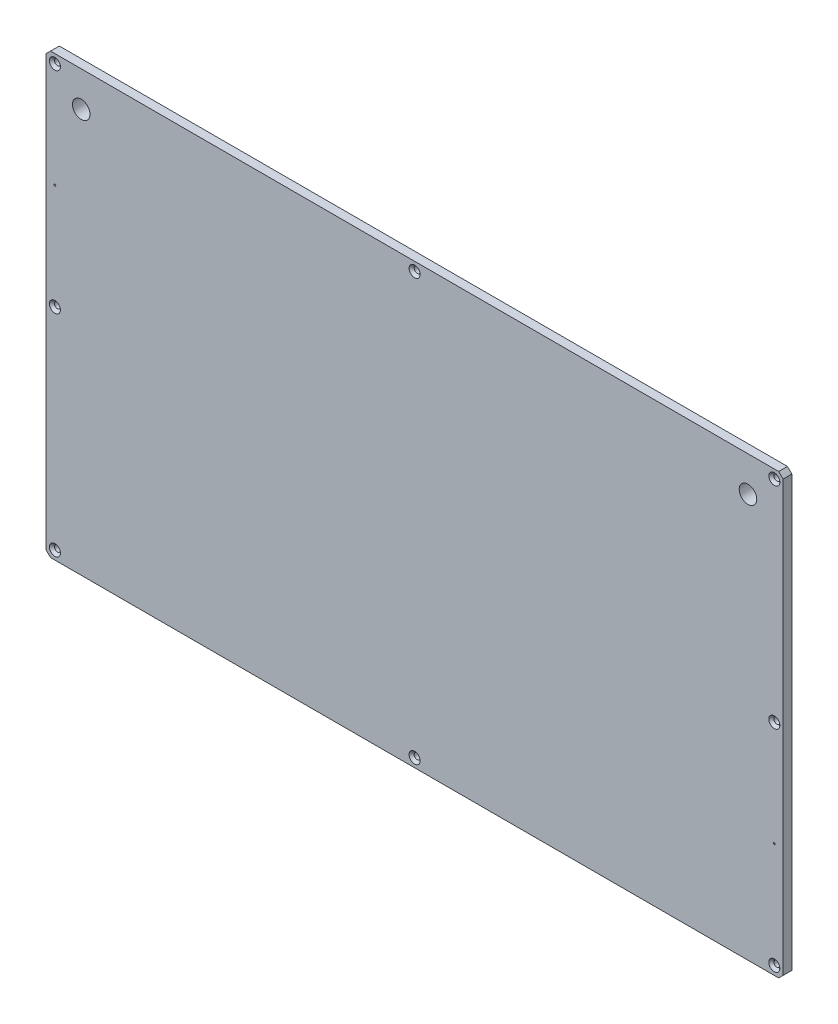
ISO-10303-21;
HEADER;
FILE_DESCRIPTION(('STEP AP214'),'2;1');
FILE_NAME('part.step','',(''),(''),'','','');
FILE_SCHEMA(('AUTOMOTIVE_DESIGN { 1 0 10303 214 1 1 1 1 }'));
ENDSEC;
DATA;
#1=APPLICATION_CONTEXT('core data for automotive mechanical design processes');
#2=APPLICATION_PROTOCOL_DEFINITION('international standard','automotive_design',2000,#1);
#3=PRODUCT_CONTEXT('',#1,'mechanical');
#4=PRODUCT('Part','Part','',(#3));
#5=PRODUCT_RELATED_PRODUCT_CATEGORY('part','',(#4));
#6=PRODUCT_DEFINITION_FORMATION('','',#4);
#7=PRODUCT_DEFINITION_CONTEXT('part definition',#1,'design');
#8=PRODUCT_DEFINITION('design','',#6,#7);
#9=PRODUCT_DEFINITION_SHAPE('','',#8);
#10=(LENGTH_UNIT() NAMED_UNIT(*) SI_UNIT(.MILLI.,.METRE.));
#11=(NAMED_UNIT(*) PLANE_ANGLE_UNIT() SI_UNIT($,.RADIAN.));
#12=(NAMED_UNIT(*) SI_UNIT($,.STERADIAN.) SOLID_ANGLE_UNIT());
#13=UNCERTAINTY_MEASURE_WITH_UNIT(LENGTH_MEASURE(1.E-05),#10,'distance_accuracy_value','');
#14=(GEOMETRIC_REPRESENTATION_CONTEXT(3) GLOBAL_UNCERTAINTY_ASSIGNED_CONTEXT((#13)) GLOBAL_UNIT_ASSIGNED_CONTEXT((#10,
#11,#12)) REPRESENTATION_CONTEXT('',''));
#15=CARTESIAN_POINT('',(0.,0.,0.));
#16=DIRECTION('',(0.,0.,1.));
#17=DIRECTION('',(1.,0.,0.));
#18=AXIS2_PLACEMENT_3D('',#15,#16,#17);
#19=CARTESIAN_POINT('',(-20.,-20.,-10.));
#20=DIRECTION('',(-1.,0.,0.));
#21=DIRECTION('',(0.,-1.,0.));
#22=AXIS2_PLACEMENT_3D('',#19,#20,#21);
#23=PLANE('',#22);
#24=DIRECTION('',(0.,0.,-1.));
#25=VECTOR('',#24,1.);
#26=CARTESIAN_POINT('',(-20.,227.5,-10.));
#27=LINE('',#26,#25);
#28=CARTESIAN_POINT('',(-20.,227.5,0.));
#29=VERTEX_POINT('',#28);
#30=CARTESIAN_POINT('',(-20.,227.5,-5.));
#31=VERTEX_POINT('',#30);
#32=EDGE_CURVE('E185',#29,#31,#27,.T.);
#33=ORIENTED_EDGE('',*,*,#32,.T.);
#34=DIRECTION('',(0.,-1.,0.));
#35=VECTOR('',#34,1.);
#36=CARTESIAN_POINT('',(-20.,-20.,-5.));
#37=LINE('',#36,#35);
#38=CARTESIAN_POINT('',(-20.,-17.5,-5.));
#39=VERTEX_POINT('',#38);
#40=EDGE_CURVE('E154',#31,#39,#37,.T.);
#41=ORIENTED_EDGE('',*,*,#40,.T.);
#42=DIRECTION('',(0.,0.,1.));
#43=VECTOR('',#42,1.);
#44=CARTESIAN_POINT('',(-20.,-17.5,-10.));
#45=LINE('',#44,#43);
#46=CARTESIAN_POINT('',(-20.,-17.5,0.));
#47=VERTEX_POINT('',#46);
#48=EDGE_CURVE('E187',#39,#47,#45,.T.);
#49=ORIENTED_EDGE('',*,*,#48,.T.);
#50=DIRECTION('',(0.,-1.,0.));
#51=VECTOR('',#50,1.);
#52=CARTESIAN_POINT('',(-20.,-20.,0.));
#53=LINE('',#52,#51);
#54=EDGE_CURVE('E354',#29,#47,#53,.T.);
#55=ORIENTED_EDGE('',*,*,#54,.F.);
#56=EDGE_LOOP('',(#33,#41,#49,#55));
#57=FACE_BOUND('',#56,.T.);
#58=ADVANCED_FACE('F34',(#57),#23,.T.);
#59=CARTESIAN_POINT('',(-20.,230.,-10.));
#60=DIRECTION('',(0.,1.,0.));
#61=DIRECTION('',(0.,0.,1.));
#62=AXIS2_PLACEMENT_3D('',#59,#60,#61);
#63=PLANE('',#62);
#64=DIRECTION('',(0.,0.,-1.));
#65=VECTOR('',#64,1.);
#66=CARTESIAN_POINT('',(397.5,230.,-10.));
#67=LINE('',#66,#65);
#68=CARTESIAN_POINT('',(397.5,230.,0.));
#69=VERTEX_POINT('',#68);
#70=CARTESIAN_POINT('',(397.5,230.,-5.));
#71=VERTEX_POINT('',#70);
#72=EDGE_CURVE('E168',#69,#71,#67,.T.);
#73=ORIENTED_EDGE('',*,*,#72,.T.);
#74=DIRECTION('',(-1.,0.,0.));
#75=VECTOR('',#74,1.);
#76=CARTESIAN_POINT('',(-20.,230.,-5.));
#77=LINE('',#76,#75);
#78=CARTESIAN_POINT('',(-17.5000000000001,230.,-5.));
#79=VERTEX_POINT('',#78);
#80=EDGE_CURVE('E151',#71,#79,#77,.T.);
#81=ORIENTED_EDGE('',*,*,#80,.T.);
#82=DIRECTION('',(0.,0.,1.));
#83=VECTOR('',#82,1.);
#84=CARTESIAN_POINT('',(-17.5000000000001,230.,-10.));
#85=LINE('',#84,#83);
#86=CARTESIAN_POINT('',(-17.5000000000001,230.,0.));
#87=VERTEX_POINT('',#86);
#88=EDGE_CURVE('E165',#79,#87,#85,.T.);
#89=ORIENTED_EDGE('',*,*,#88,.T.);
#90=DIRECTION('',(-1.,0.,0.));
#91=VECTOR('',#90,1.);
#92=CARTESIAN_POINT('',(-20.,230.,0.));
#93=LINE('',#92,#91);
#94=EDGE_CURVE('E363',#69,#87,#93,.T.);
#95=ORIENTED_EDGE('',*,*,#94,.F.);
#96=EDGE_LOOP('',(#73,#81,#89,#95));
#97=FACE_BOUND('',#96,.T.);
#98=ADVANCED_FACE('F163',(#97),#63,.T.);
#99=CARTESIAN_POINT('',(400.,-20.,-10.));
#100=DIRECTION('',(1.,0.,0.));
#101=DIRECTION('',(0.,0.,-1.));
#102=AXIS2_PLACEMENT_3D('',#99,#100,#101);
#103=PLANE('',#102);
#104=DIRECTION('',(0.,0.,-1.));
#105=VECTOR('',#104,1.);
#106=CARTESIAN_POINT('',(400.,-17.5,-10.));
#107=LINE('',#106,#105);
#108=CARTESIAN_POINT('',(400.,-17.5,0.));
#109=VERTEX_POINT('',#108);
#110=CARTESIAN_POINT('',(400.,-17.5,-5.));
#111=VERTEX_POINT('',#110);
#112=EDGE_CURVE('E365',#109,#111,#107,.T.);
#113=ORIENTED_EDGE('',*,*,#112,.T.);
#114=DIRECTION('',(0.,1.,0.));
#115=VECTOR('',#114,1.);
#116=CARTESIAN_POINT('',(400.,-20.,-5.));
#117=LINE('',#116,#115);
#118=CARTESIAN_POINT('',(400.,227.5,-5.));
#119=VERTEX_POINT('',#118);
#120=EDGE_CURVE('E300',#111,#119,#117,.T.);
#121=ORIENTED_EDGE('',*,*,#120,.T.);
#122=DIRECTION('',(0.,0.,1.));
#123=VECTOR('',#122,1.);
#124=CARTESIAN_POINT('',(400.,227.5,-10.));
#125=LINE('',#124,#123);
#126=CARTESIAN_POINT('',(400.,227.5,0.));
#127=VERTEX_POINT('',#126);
#128=EDGE_CURVE('E368',#119,#127,#125,.T.);
#129=ORIENTED_EDGE('',*,*,#128,.T.);
#130=DIRECTION('',(0.,1.,0.));
#131=VECTOR('',#130,1.);
#132=CARTESIAN_POINT('',(400.,-20.,0.));
#133=LINE('',#132,#131);
#134=EDGE_CURVE('E360',#109,#127,#133,.T.);
#135=ORIENTED_EDGE('',*,*,#134,.F.);
#136=EDGE_LOOP('',(#113,#121,#129,#135));
#137=FACE_BOUND('',#136,.T.);
#138=ADVANCED_FACE('F381',(#137),#103,.T.);
#139=CARTESIAN_POINT('',(-20.,-20.,-10.));
#140=DIRECTION('',(0.,-1.,0.));
#141=DIRECTION('',(1.,0.,0.));
#142=AXIS2_PLACEMENT_3D('',#139,#140,#141);
#143=PLANE('',#142);
#144=DIRECTION('',(0.,0.,-1.));
#145=VECTOR('',#144,1.);
#146=CARTESIAN_POINT('',(-17.4999999999999,-20.,-10.));
#147=LINE('',#146,#145);
#148=CARTESIAN_POINT('',(-17.4999999999999,-20.,0.));
#149=VERTEX_POINT('',#148);
#150=CARTESIAN_POINT('',(-17.4999999999999,-20.,-5.));
#151=VERTEX_POINT('',#150);
#152=EDGE_CURVE('E175',#149,#151,#147,.T.);
#153=ORIENTED_EDGE('',*,*,#152,.T.);
#154=DIRECTION('',(1.,0.,0.));
#155=VECTOR('',#154,1.);
#156=CARTESIAN_POINT('',(-20.,-20.,-5.));
#157=LINE('',#156,#155);
#158=CARTESIAN_POINT('',(397.5,-20.,-5.));
#159=VERTEX_POINT('',#158);
#160=EDGE_CURVE('E297',#151,#159,#157,.T.);
#161=ORIENTED_EDGE('',*,*,#160,.T.);
#162=DIRECTION('',(0.,0.,1.));
#163=VECTOR('',#162,1.);
#164=CARTESIAN_POINT('',(397.5,-20.,-10.));
#165=LINE('',#164,#163);
#166=CARTESIAN_POINT('',(397.5,-20.,0.));
#167=VERTEX_POINT('',#166);
#168=EDGE_CURVE('E183',#159,#167,#165,.T.);
#169=ORIENTED_EDGE('',*,*,#168,.T.);
#170=DIRECTION('',(1.,0.,0.));
#171=VECTOR('',#170,1.);
#172=CARTESIAN_POINT('',(-20.,-20.,0.));
#173=LINE('',#172,#171);
#174=EDGE_CURVE('E357',#149,#167,#173,.T.);
#175=ORIENTED_EDGE('',*,*,#174,.F.);
#176=EDGE_LOOP('',(#153,#161,#169,#175));
#177=FACE_BOUND('',#176,.T.);
#178=ADVANCED_FACE('F386',(#177),#143,.T.);
#179=CARTESIAN_POINT('',(400.,227.5,-10.));
#180=DIRECTION('',(-0.707106781186547,-0.707106781186547,0.));
#181=DIRECTION('',(0.,0.,1.));
#182=AXIS2_PLACEMENT_3D('',#179,#180,#181);
#183=PLANE('',#182);
#184=ORIENTED_EDGE('',*,*,#128,.F.);
#185=DIRECTION('',(0.707106781186548,-0.707106781186548,0.));
#186=VECTOR('',#185,1.);
#187=CARTESIAN_POINT('',(400.,227.5,-5.));
#188=LINE('',#187,#186);
#189=EDGE_CURVE('E295',#119,#71,#188,.F.);
#190=ORIENTED_EDGE('',*,*,#189,.T.);
#191=ORIENTED_EDGE('',*,*,#72,.F.);
#192=DIRECTION('',(0.707106781186548,-0.707106781186548,0.));
#193=VECTOR('',#192,1.);
#194=CARTESIAN_POINT('',(400.,227.5,0.));
#195=LINE('',#194,#193);
#196=EDGE_CURVE('E173',#127,#69,#195,.F.);
#197=ORIENTED_EDGE('',*,*,#196,.F.);
#198=EDGE_LOOP('',(#184,#190,#191,#197));
#199=FACE_BOUND('',#198,.T.);
#200=ADVANCED_FACE('F395',(#199),#183,.F.);
#201=CARTESIAN_POINT('',(397.5,-20.,-10.));
#202=DIRECTION('',(-0.707106781186547,0.707106781186547,0.));
#203=DIRECTION('',(0.,0.,1.));
#204=AXIS2_PLACEMENT_3D('',#201,#202,#203);
#205=PLANE('',#204);
#206=ORIENTED_EDGE('',*,*,#168,.F.);
#207=DIRECTION('',(-0.707106781186548,-0.707106781186548,0.));
#208=VECTOR('',#207,1.);
#209=CARTESIAN_POINT('',(397.5,-20.,-5.));
#210=LINE('',#209,#208);
#211=EDGE_CURVE('E303',#159,#111,#210,.F.);
#212=ORIENTED_EDGE('',*,*,#211,.T.);
#213=ORIENTED_EDGE('',*,*,#112,.F.);
#214=DIRECTION('',(-0.707106781186548,-0.707106781186548,0.));
#215=VECTOR('',#214,1.);
#216=CARTESIAN_POINT('',(397.5,-20.,0.));
#217=LINE('',#216,#215);
#218=EDGE_CURVE('E177',#167,#109,#217,.F.);
#219=ORIENTED_EDGE('',*,*,#218,.F.);
#220=EDGE_LOOP('',(#206,#212,#213,#219));
#221=FACE_BOUND('',#220,.T.);
#222=ADVANCED_FACE('F384',(#221),#205,.F.);
#223=CARTESIAN_POINT('',(-20.,-17.5,-10.));
#224=DIRECTION('',(0.70710678118654,0.707106781186555,0.));
#225=DIRECTION('',(0.,0.,1.));
#226=AXIS2_PLACEMENT_3D('',#223,#224,#225);
#227=PLANE('',#226);
#228=ORIENTED_EDGE('',*,*,#48,.F.);
#229=DIRECTION('',(-0.707106781186555,0.70710678118654,0.));
#230=VECTOR('',#229,1.);
#231=CARTESIAN_POINT('',(-20.,-17.5,-5.));
#232=LINE('',#231,#230);
#233=EDGE_CURVE('E292',#39,#151,#232,.F.);
#234=ORIENTED_EDGE('',*,*,#233,.T.);
#235=ORIENTED_EDGE('',*,*,#152,.F.);
#236=DIRECTION('',(-0.707106781186555,0.70710678118654,0.));
#237=VECTOR('',#236,1.);
#238=CARTESIAN_POINT('',(-20.,-17.5,0.));
#239=LINE('',#238,#237);
#240=EDGE_CURVE('E371',#47,#149,#239,.F.);
#241=ORIENTED_EDGE('',*,*,#240,.F.);
#242=EDGE_LOOP('',(#228,#234,#235,#241));
#243=FACE_BOUND('',#242,.T.);
#244=ADVANCED_FACE('F391',(#243),#227,.F.);
#245=CARTESIAN_POINT('',(-17.5000000000001,230.,-10.));
#246=DIRECTION('',(0.707106781186555,-0.70710678118654,0.));
#247=DIRECTION('',(0.,0.,1.));
#248=AXIS2_PLACEMENT_3D('',#245,#246,#247);
#249=PLANE('',#248);
#250=ORIENTED_EDGE('',*,*,#88,.F.);
#251=DIRECTION('',(0.70710678118654,0.707106781186555,0.));
#252=VECTOR('',#251,1.);
#253=CARTESIAN_POINT('',(-17.5000000000001,230.,-5.));
#254=LINE('',#253,#252);
#255=EDGE_CURVE('E148',#79,#31,#254,.F.);
#256=ORIENTED_EDGE('',*,*,#255,.T.);
#257=ORIENTED_EDGE('',*,*,#32,.F.);
#258=DIRECTION('',(0.70710678118654,0.707106781186555,0.));
#259=VECTOR('',#258,1.);
#260=CARTESIAN_POINT('',(-17.5000000000001,230.,0.));
#261=LINE('',#260,#259);
#262=EDGE_CURVE('E171',#87,#29,#261,.F.);
#263=ORIENTED_EDGE('',*,*,#262,.F.);
#264=EDGE_LOOP('',(#250,#256,#257,#263));
#265=FACE_BOUND('',#264,.T.);
#266=ADVANCED_FACE('F170',(#265),#249,.F.);
#267=CARTESIAN_POINT('',(395.,105.,0.));
#268=DIRECTION('',(0.,0.,1.));
#269=DIRECTION('',(1.,0.,0.));
#270=AXIS2_PLACEMENT_3D('',#267,#268,#269);
#271=CYLINDRICAL_SURFACE('',#270,1.69999999999998);
#272=CARTESIAN_POINT('',(395.,105.,-1.45000000000001));
#273=DIRECTION('',(0.,0.,1.));
#274=DIRECTION('',(1.,0.,0.));
#275=AXIS2_PLACEMENT_3D('',#272,#273,#274);
#276=CIRCLE('',#275,1.69999999999998);
#277=CARTESIAN_POINT('',(396.7,105.,-1.45000000000001));
#278=VERTEX_POINT('',#277);
#279=EDGE_CURVE('E351',#278,#278,#276,.T.);
#280=ORIENTED_EDGE('',*,*,#279,.T.);
#281=EDGE_LOOP('',(#280));
#282=FACE_BOUND('',#281,.T.);
#283=CARTESIAN_POINT('',(395.,105.,-5.));
#284=DIRECTION('',(0.,0.,-1.));
#285=DIRECTION('',(-1.,0.,0.));
#286=AXIS2_PLACEMENT_3D('',#283,#284,#285);
#287=CIRCLE('',#286,1.69999999999998);
#288=CARTESIAN_POINT('',(393.3,105.,-5.));
#289=VERTEX_POINT('',#288);
#290=EDGE_CURVE('E159',#289,#289,#287,.F.);
#291=ORIENTED_EDGE('',*,*,#290,.F.);
#292=EDGE_LOOP('',(#291));
#293=FACE_BOUND('',#292,.T.);
#294=ADVANCED_FACE('F424',(#282,#293),#271,.F.);
#295=CARTESIAN_POINT('',(-15.,105.,0.));
#296=DIRECTION('',(0.,0.,1.));
#297=DIRECTION('',(1.,0.,0.));
#298=AXIS2_PLACEMENT_3D('',#295,#296,#297);
#299=CYLINDRICAL_SURFACE('',#298,1.69999999999999);
#300=CARTESIAN_POINT('',(-15.,105.,-1.45000000000001));
#301=DIRECTION('',(0.,0.,1.));
#302=DIRECTION('',(1.,0.,0.));
#303=AXIS2_PLACEMENT_3D('',#300,#301,#302);
#304=CIRCLE('',#303,1.69999999999999);
#305=CARTESIAN_POINT('',(-13.3,105.,-1.45000000000001));
#306=VERTEX_POINT('',#305);
#307=EDGE_CURVE('E345',#306,#306,#304,.T.);
#308=ORIENTED_EDGE('',*,*,#307,.T.);
#309=EDGE_LOOP('',(#308));
#310=FACE_BOUND('',#309,.T.);
#311=CARTESIAN_POINT('',(-15.,105.,-5.));
#312=DIRECTION('',(0.,0.,-1.));
#313=DIRECTION('',(-1.,0.,0.));
#314=AXIS2_PLACEMENT_3D('',#311,#312,#313);
#315=CIRCLE('',#314,1.69999999999999);
#316=CARTESIAN_POINT('',(-16.7,105.,-5.));
#317=VERTEX_POINT('',#316);
#318=EDGE_CURVE('E286',#317,#317,#315,.F.);
#319=ORIENTED_EDGE('',*,*,#318,.F.);
#320=EDGE_LOOP('',(#319));
#321=FACE_BOUND('',#320,.T.);
#322=ADVANCED_FACE('F427',(#310,#321),#299,.F.);
#323=CARTESIAN_POINT('',(-15.,-15.,0.));
#324=DIRECTION('',(0.,0.,1.));
#325=DIRECTION('',(1.,0.,0.));
#326=AXIS2_PLACEMENT_3D('',#323,#324,#325);
#327=CYLINDRICAL_SURFACE('',#326,1.69999999999999);
#328=CARTESIAN_POINT('',(-15.,-15.,-1.45000000000001));
#329=DIRECTION('',(0.,0.,1.));
#330=DIRECTION('',(1.,0.,0.));
#331=AXIS2_PLACEMENT_3D('',#328,#329,#330);
#332=CIRCLE('',#331,1.69999999999999);
#333=CARTESIAN_POINT('',(-13.3,-15.,-1.45000000000001));
#334=VERTEX_POINT('',#333);
#335=EDGE_CURVE('E339',#334,#334,#332,.T.);
#336=ORIENTED_EDGE('',*,*,#335,.T.);
#337=EDGE_LOOP('',(#336));
#338=FACE_BOUND('',#337,.T.);
#339=CARTESIAN_POINT('',(-15.,-15.,-5.));
#340=DIRECTION('',(0.,0.,-1.));
#341=DIRECTION('',(-1.,0.,0.));
#342=AXIS2_PLACEMENT_3D('',#339,#340,#341);
#343=CIRCLE('',#342,1.69999999999999);
#344=CARTESIAN_POINT('',(-16.7,-15.,-5.));
#345=VERTEX_POINT('',#344);
#346=EDGE_CURVE('E283',#345,#345,#343,.F.);
#347=ORIENTED_EDGE('',*,*,#346,.F.);
#348=EDGE_LOOP('',(#347));
#349=FACE_BOUND('',#348,.T.);
#350=ADVANCED_FACE('F435',(#338,#349),#327,.F.);
#351=CARTESIAN_POINT('',(190.,-15.,0.));
#352=DIRECTION('',(0.,0.,1.));
#353=DIRECTION('',(1.,0.,0.));
#354=AXIS2_PLACEMENT_3D('',#351,#352,#353);
#355=CYLINDRICAL_SURFACE('',#354,1.69999999999998);
#356=CARTESIAN_POINT('',(190.,-15.,-1.45000000000001));
#357=DIRECTION('',(0.,0.,1.));
#358=DIRECTION('',(1.,0.,0.));
#359=AXIS2_PLACEMENT_3D('',#356,#357,#358);
#360=CIRCLE('',#359,1.69999999999998);
#361=CARTESIAN_POINT('',(191.7,-15.,-1.45000000000001));
#362=VERTEX_POINT('',#361);
#363=EDGE_CURVE('E333',#362,#362,#360,.T.);
#364=ORIENTED_EDGE('',*,*,#363,.T.);
#365=EDGE_LOOP('',(#364));
#366=FACE_BOUND('',#365,.T.);
#367=CARTESIAN_POINT('',(190.,-15.,-5.));
#368=DIRECTION('',(0.,0.,-1.));
#369=DIRECTION('',(-1.,0.,0.));
#370=AXIS2_PLACEMENT_3D('',#367,#368,#369);
#371=CIRCLE('',#370,1.69999999999998);
#372=CARTESIAN_POINT('',(188.3,-15.,-5.));
#373=VERTEX_POINT('',#372);
#374=EDGE_CURVE('E280',#373,#373,#371,.F.);
#375=ORIENTED_EDGE('',*,*,#374,.F.);
#376=EDGE_LOOP('',(#375));
#377=FACE_BOUND('',#376,.T.);
#378=ADVANCED_FACE('F443',(#366,#377),#355,.F.);
#379=CARTESIAN_POINT('',(395.,-15.,0.));
#380=DIRECTION('',(0.,0.,1.));
#381=DIRECTION('',(1.,0.,0.));
#382=AXIS2_PLACEMENT_3D('',#379,#380,#381);
#383=CYLINDRICAL_SURFACE('',#382,1.69999999999998);
#384=CARTESIAN_POINT('',(395.,-15.,-1.45000000000001));
#385=DIRECTION('',(0.,0.,1.));
#386=DIRECTION('',(1.,0.,0.));
#387=AXIS2_PLACEMENT_3D('',#384,#385,#386);
#388=CIRCLE('',#387,1.69999999999998);
#389=CARTESIAN_POINT('',(396.7,-15.,-1.45000000000001));
#390=VERTEX_POINT('',#389);
#391=EDGE_CURVE('E327',#390,#390,#388,.T.);
#392=ORIENTED_EDGE('',*,*,#391,.T.);
#393=EDGE_LOOP('',(#392));
#394=FACE_BOUND('',#393,.T.);
#395=CARTESIAN_POINT('',(395.,-15.,-5.));
#396=DIRECTION('',(0.,0.,-1.));
#397=DIRECTION('',(-1.,0.,0.));
#398=AXIS2_PLACEMENT_3D('',#395,#396,#397);
#399=CIRCLE('',#398,1.69999999999998);
#400=CARTESIAN_POINT('',(393.3,-15.,-5.));
#401=VERTEX_POINT('',#400);
#402=EDGE_CURVE('E277',#401,#401,#399,.F.);
#403=ORIENTED_EDGE('',*,*,#402,.F.);
#404=EDGE_LOOP('',(#403));
#405=FACE_BOUND('',#404,.T.);
#406=ADVANCED_FACE('F451',(#394,#405),#383,.F.);
#407=CARTESIAN_POINT('',(395.,225.,0.));
#408=DIRECTION('',(0.,0.,1.));
#409=DIRECTION('',(1.,0.,0.));
#410=AXIS2_PLACEMENT_3D('',#407,#408,#409);
#411=CYLINDRICAL_SURFACE('',#410,1.69999999999998);
#412=CARTESIAN_POINT('',(395.,225.,-1.45000000000001));
#413=DIRECTION('',(0.,0.,1.));
#414=DIRECTION('',(1.,0.,0.));
#415=AXIS2_PLACEMENT_3D('',#412,#413,#414);
#416=CIRCLE('',#415,1.69999999999998);
#417=CARTESIAN_POINT('',(396.7,225.,-1.45000000000001));
#418=VERTEX_POINT('',#417);
#419=EDGE_CURVE('E321',#418,#418,#416,.T.);
#420=ORIENTED_EDGE('',*,*,#419,.T.);
#421=EDGE_LOOP('',(#420));
#422=FACE_BOUND('',#421,.T.);
#423=CARTESIAN_POINT('',(395.,225.,-5.));
#424=DIRECTION('',(0.,0.,-1.));
#425=DIRECTION('',(-1.,0.,0.));
#426=AXIS2_PLACEMENT_3D('',#423,#424,#425);
#427=CIRCLE('',#426,1.69999999999998);
#428=CARTESIAN_POINT('',(393.3,225.,-5.));
#429=VERTEX_POINT('',#428);
#430=EDGE_CURVE('E274',#429,#429,#427,.F.);
#431=ORIENTED_EDGE('',*,*,#430,.F.);
#432=EDGE_LOOP('',(#431));
#433=FACE_BOUND('',#432,.T.);
#434=ADVANCED_FACE('F459',(#422,#433),#411,.F.);
#435=CARTESIAN_POINT('',(190.,225.,0.));
#436=DIRECTION('',(0.,0.,1.));
#437=DIRECTION('',(1.,0.,0.));
#438=AXIS2_PLACEMENT_3D('',#435,#436,#437);
#439=CYLINDRICAL_SURFACE('',#438,1.69999999999998);
#440=CARTESIAN_POINT('',(190.,225.,-1.45000000000001));
#441=DIRECTION('',(0.,0.,1.));
#442=DIRECTION('',(1.,0.,0.));
#443=AXIS2_PLACEMENT_3D('',#440,#441,#442);
#444=CIRCLE('',#443,1.69999999999998);
#445=CARTESIAN_POINT('',(191.7,225.,-1.45000000000001));
#446=VERTEX_POINT('',#445);
#447=EDGE_CURVE('E315',#446,#446,#444,.T.);
#448=ORIENTED_EDGE('',*,*,#447,.T.);
#449=EDGE_LOOP('',(#448));
#450=FACE_BOUND('',#449,.T.);
#451=CARTESIAN_POINT('',(190.,225.,-5.));
#452=DIRECTION('',(0.,0.,-1.));
#453=DIRECTION('',(-1.,0.,0.));
#454=AXIS2_PLACEMENT_3D('',#451,#452,#453);
#455=CIRCLE('',#454,1.69999999999998);
#456=CARTESIAN_POINT('',(188.3,225.,-5.));
#457=VERTEX_POINT('',#456);
#458=EDGE_CURVE('E193',#457,#457,#455,.F.);
#459=ORIENTED_EDGE('',*,*,#458,.F.);
#460=EDGE_LOOP('',(#459));
#461=FACE_BOUND('',#460,.T.);
#462=ADVANCED_FACE('F467',(#450,#461),#439,.F.);
#463=CARTESIAN_POINT('',(-15.,225.,0.));
#464=DIRECTION('',(0.,0.,1.));
#465=DIRECTION('',(1.,0.,0.));
#466=AXIS2_PLACEMENT_3D('',#463,#464,#465);
#467=CYLINDRICAL_SURFACE('',#466,1.69999999999999);
#468=CARTESIAN_POINT('',(-15.,225.,-1.45000000000001));
#469=DIRECTION('',(0.,0.,1.));
#470=DIRECTION('',(1.,0.,0.));
#471=AXIS2_PLACEMENT_3D('',#468,#469,#470);
#472=CIRCLE('',#471,1.69999999999999);
#473=CARTESIAN_POINT('',(-13.3,225.,-1.45000000000001));
#474=VERTEX_POINT('',#473);
#475=EDGE_CURVE('E309',#474,#474,#472,.T.);
#476=ORIENTED_EDGE('',*,*,#475,.T.);
#477=EDGE_LOOP('',(#476));
#478=FACE_BOUND('',#477,.T.);
#479=CARTESIAN_POINT('',(-15.,225.,-5.));
#480=DIRECTION('',(0.,0.,-1.));
#481=DIRECTION('',(-1.,0.,0.));
#482=AXIS2_PLACEMENT_3D('',#479,#480,#481);
#483=CIRCLE('',#482,1.69999999999999);
#484=CARTESIAN_POINT('',(-16.7,225.,-5.));
#485=VERTEX_POINT('',#484);
#486=EDGE_CURVE('E190',#485,#485,#483,.F.);
#487=ORIENTED_EDGE('',*,*,#486,.F.);
#488=EDGE_LOOP('',(#487));
#489=FACE_BOUND('',#488,.T.);
#490=ADVANCED_FACE('F416',(#478,#489),#467,.F.);
#491=CARTESIAN_POINT('',(0.,0.,0.));
#492=DIRECTION('',(0.,0.,-1.));
#493=DIRECTION('',(-1.,0.,0.));
#494=AXIS2_PLACEMENT_3D('',#491,#492,#493);
#495=PLANE('',#494);
#496=CARTESIAN_POINT('',(-15.,165.,0.));
#497=DIRECTION('',(0.,0.,1.));
#498=DIRECTION('',(1.,0.,0.));
#499=AXIS2_PLACEMENT_3D('',#496,#497,#498);
#500=CIRCLE('',#499,0.499999999999988);
#501=CARTESIAN_POINT('',(-14.5,165.,0.));
#502=VERTEX_POINT('',#501);
#503=EDGE_CURVE('E239',#502,#502,#500,.T.);
#504=ORIENTED_EDGE('',*,*,#503,.F.);
#505=EDGE_LOOP('',(#504));
#506=FACE_BOUND('',#505,.T.);
#507=CARTESIAN_POINT('',(395.,45.,0.));
#508=DIRECTION('',(0.,0.,1.));
#509=DIRECTION('',(1.,0.,0.));
#510=AXIS2_PLACEMENT_3D('',#507,#508,#509);
#511=CIRCLE('',#510,0.5);
#512=CARTESIAN_POINT('',(395.5,45.,0.));
#513=VERTEX_POINT('',#512);
#514=EDGE_CURVE('E228',#513,#513,#511,.T.);
#515=ORIENTED_EDGE('',*,*,#514,.F.);
#516=EDGE_LOOP('',(#515));
#517=FACE_BOUND('',#516,.T.);
#518=CARTESIAN_POINT('',(380.,210.,0.));
#519=DIRECTION('',(0.,0.,1.));
#520=DIRECTION('',(1.,0.,0.));
#521=AXIS2_PLACEMENT_3D('',#518,#519,#520);
#522=CIRCLE('',#521,5.);
#523=CARTESIAN_POINT('',(385.,210.,0.));
#524=VERTEX_POINT('',#523);
#525=EDGE_CURVE('E227',#524,#524,#522,.T.);
#526=ORIENTED_EDGE('',*,*,#525,.F.);
#527=EDGE_LOOP('',(#526));
#528=FACE_BOUND('',#527,.T.);
#529=CARTESIAN_POINT('',(0.,210.,0.));
#530=DIRECTION('',(0.,0.,1.));
#531=DIRECTION('',(1.,0.,0.));
#532=AXIS2_PLACEMENT_3D('',#529,#530,#531);
#533=CIRCLE('',#532,4.99999999999999);
#534=CARTESIAN_POINT('',(4.99999999999999,210.,0.));
#535=VERTEX_POINT('',#534);
#536=EDGE_CURVE('E244',#535,#535,#533,.T.);
#537=ORIENTED_EDGE('',*,*,#536,.F.);
#538=EDGE_LOOP('',(#537));
#539=FACE_BOUND('',#538,.T.);
#540=CARTESIAN_POINT('',(-15.,225.,0.));
#541=DIRECTION('',(0.,0.,1.));
#542=DIRECTION('',(1.,0.,0.));
#543=AXIS2_PLACEMENT_3D('',#540,#541,#542);
#544=CIRCLE('',#543,3.15);
#545=CARTESIAN_POINT('',(-11.85,225.,0.));
#546=VERTEX_POINT('',#545);
#547=EDGE_CURVE('E306',#546,#546,#544,.T.);
#548=ORIENTED_EDGE('',*,*,#547,.F.);
#549=EDGE_LOOP('',(#548));
#550=FACE_BOUND('',#549,.T.);
#551=CARTESIAN_POINT('',(190.,225.,0.));
#552=DIRECTION('',(0.,0.,1.));
#553=DIRECTION('',(1.,0.,0.));
#554=AXIS2_PLACEMENT_3D('',#551,#552,#553);
#555=CIRCLE('',#554,3.14999999999999);
#556=CARTESIAN_POINT('',(193.15,225.,0.));
#557=VERTEX_POINT('',#556);
#558=EDGE_CURVE('E312',#557,#557,#555,.T.);
#559=ORIENTED_EDGE('',*,*,#558,.F.);
#560=EDGE_LOOP('',(#559));
#561=FACE_BOUND('',#560,.T.);
#562=CARTESIAN_POINT('',(395.,225.,0.));
#563=DIRECTION('',(0.,0.,1.));
#564=DIRECTION('',(1.,0.,0.));
#565=AXIS2_PLACEMENT_3D('',#562,#563,#564);
#566=CIRCLE('',#565,3.14999999999999);
#567=CARTESIAN_POINT('',(398.15,225.,0.));
#568=VERTEX_POINT('',#567);
#569=EDGE_CURVE('E318',#568,#568,#566,.T.);
#570=ORIENTED_EDGE('',*,*,#569,.F.);
#571=EDGE_LOOP('',(#570));
#572=FACE_BOUND('',#571,.T.);
#573=CARTESIAN_POINT('',(395.,-15.,0.));
#574=DIRECTION('',(0.,0.,1.));
#575=DIRECTION('',(1.,0.,0.));
#576=AXIS2_PLACEMENT_3D('',#573,#574,#575);
#577=CIRCLE('',#576,3.14999999999999);
#578=CARTESIAN_POINT('',(398.15,-15.,0.));
#579=VERTEX_POINT('',#578);
#580=EDGE_CURVE('E324',#579,#579,#577,.T.);
#581=ORIENTED_EDGE('',*,*,#580,.F.);
#582=EDGE_LOOP('',(#581));
#583=FACE_BOUND('',#582,.T.);
#584=CARTESIAN_POINT('',(190.,-15.,0.));
#585=DIRECTION('',(0.,0.,1.));
#586=DIRECTION('',(1.,0.,0.));
#587=AXIS2_PLACEMENT_3D('',#584,#585,#586);
#588=CIRCLE('',#587,3.14999999999999);
#589=CARTESIAN_POINT('',(193.15,-15.,0.));
#590=VERTEX_POINT('',#589);
#591=EDGE_CURVE('E330',#590,#590,#588,.T.);
#592=ORIENTED_EDGE('',*,*,#591,.F.);
#593=EDGE_LOOP('',(#592));
#594=FACE_BOUND('',#593,.T.);
#595=CARTESIAN_POINT('',(-15.,-15.,0.));
#596=DIRECTION('',(0.,0.,1.));
#597=DIRECTION('',(1.,0.,0.));
#598=AXIS2_PLACEMENT_3D('',#595,#596,#597);
#599=CIRCLE('',#598,3.15);
#600=CARTESIAN_POINT('',(-11.85,-15.,0.));
#601=VERTEX_POINT('',#600);
#602=EDGE_CURVE('E336',#601,#601,#599,.T.);
#603=ORIENTED_EDGE('',*,*,#602,.F.);
#604=EDGE_LOOP('',(#603));
#605=FACE_BOUND('',#604,.T.);
#606=CARTESIAN_POINT('',(-15.,105.,0.));
#607=DIRECTION('',(0.,0.,1.));
#608=DIRECTION('',(1.,0.,0.));
#609=AXIS2_PLACEMENT_3D('',#606,#607,#608);
#610=CIRCLE('',#609,3.15);
#611=CARTESIAN_POINT('',(-11.85,105.,0.));
#612=VERTEX_POINT('',#611);
#613=EDGE_CURVE('E342',#612,#612,#610,.T.);
#614=ORIENTED_EDGE('',*,*,#613,.F.);
#615=EDGE_LOOP('',(#614));
#616=FACE_BOUND('',#615,.T.);
#617=CARTESIAN_POINT('',(395.,105.,0.));
#618=DIRECTION('',(0.,0.,1.));
#619=DIRECTION('',(1.,0.,0.));
#620=AXIS2_PLACEMENT_3D('',#617,#618,#619);
#621=CIRCLE('',#620,3.14999999999999);
#622=CARTESIAN_POINT('',(398.15,105.,0.));
#623=VERTEX_POINT('',#622);
#624=EDGE_CURVE('E348',#623,#623,#621,.T.);
#625=ORIENTED_EDGE('',*,*,#624,.F.);
#626=EDGE_LOOP('',(#625));
#627=FACE_BOUND('',#626,.T.);
#628=ORIENTED_EDGE('',*,*,#134,.T.);
#629=ORIENTED_EDGE('',*,*,#196,.T.);
#630=ORIENTED_EDGE('',*,*,#94,.T.);
#631=ORIENTED_EDGE('',*,*,#262,.T.);
#632=ORIENTED_EDGE('',*,*,#54,.T.);
#633=ORIENTED_EDGE('',*,*,#240,.T.);
#634=ORIENTED_EDGE('',*,*,#174,.T.);
#635=ORIENTED_EDGE('',*,*,#218,.T.);
#636=EDGE_LOOP('',(#628,#629,#630,#631,#632,#633,#634,#635));
#637=FACE_BOUND('',#636,.T.);
#638=ADVANCED_FACE('F375',(#506,#517,#528,#539,#550,#561,#572,#583,#594,#605,#616,#627,#637),
#495,.F.);
#639=CARTESIAN_POINT('',(395.,105.,0.));
#640=DIRECTION('',(0.,0.,1.));
#641=DIRECTION('',(1.,0.,0.));
#642=AXIS2_PLACEMENT_3D('',#639,#640,#641);
#643=CONICAL_SURFACE('',#642,3.14999999999999,0.785398163397448);
#644=ORIENTED_EDGE('',*,*,#279,.F.);
#645=EDGE_LOOP('',(#644));
#646=FACE_BOUND('',#645,.T.);
#647=ORIENTED_EDGE('',*,*,#624,.T.);
#648=EDGE_LOOP('',(#647));
#649=FACE_BOUND('',#648,.T.);
#650=ADVANCED_FACE('F415',(#646,#649),#643,.F.);
#651=CARTESIAN_POINT('',(-15.,105.,0.));
#652=DIRECTION('',(0.,0.,1.));
#653=DIRECTION('',(1.,0.,0.));
#654=AXIS2_PLACEMENT_3D('',#651,#652,#653);
#655=CONICAL_SURFACE('',#654,3.15,0.78539816339745);
#656=ORIENTED_EDGE('',*,*,#307,.F.);
#657=EDGE_LOOP('',(#656));
#658=FACE_BOUND('',#657,.T.);
#659=ORIENTED_EDGE('',*,*,#613,.T.);
#660=EDGE_LOOP('',(#659));
#661=FACE_BOUND('',#660,.T.);
#662=ADVANCED_FACE('F431',(#658,#661),#655,.F.);
#663=CARTESIAN_POINT('',(-15.,-15.,0.));
#664=DIRECTION('',(0.,0.,1.));
#665=DIRECTION('',(1.,0.,0.));
#666=AXIS2_PLACEMENT_3D('',#663,#664,#665);
#667=CONICAL_SURFACE('',#666,3.15,0.78539816339745);
#668=ORIENTED_EDGE('',*,*,#335,.F.);
#669=EDGE_LOOP('',(#668));
#670=FACE_BOUND('',#669,.T.);
#671=ORIENTED_EDGE('',*,*,#602,.T.);
#672=EDGE_LOOP('',(#671));
#673=FACE_BOUND('',#672,.T.);
#674=ADVANCED_FACE('F439',(#670,#673),#667,.F.);
#675=CARTESIAN_POINT('',(190.,-15.,0.));
#676=DIRECTION('',(0.,0.,1.));
#677=DIRECTION('',(1.,0.,0.));
#678=AXIS2_PLACEMENT_3D('',#675,#676,#677);
#679=CONICAL_SURFACE('',#678,3.14999999999999,0.785398163397448);
#680=ORIENTED_EDGE('',*,*,#363,.F.);
#681=EDGE_LOOP('',(#680));
#682=FACE_BOUND('',#681,.T.);
#683=ORIENTED_EDGE('',*,*,#591,.T.);
#684=EDGE_LOOP('',(#683));
#685=FACE_BOUND('',#684,.T.);
#686=ADVANCED_FACE('F447',(#682,#685),#679,.F.);
#687=CARTESIAN_POINT('',(395.,-15.,0.));
#688=DIRECTION('',(0.,0.,1.));
#689=DIRECTION('',(1.,0.,0.));
#690=AXIS2_PLACEMENT_3D('',#687,#688,#689);
#691=CONICAL_SURFACE('',#690,3.14999999999999,0.785398163397448);
#692=ORIENTED_EDGE('',*,*,#391,.F.);
#693=EDGE_LOOP('',(#692));
#694=FACE_BOUND('',#693,.T.);
#695=ORIENTED_EDGE('',*,*,#580,.T.);
#696=EDGE_LOOP('',(#695));
#697=FACE_BOUND('',#696,.T.);
#698=ADVANCED_FACE('F455',(#694,#697),#691,.F.);
#699=CARTESIAN_POINT('',(395.,225.,0.));
#700=DIRECTION('',(0.,0.,1.));
#701=DIRECTION('',(1.,0.,0.));
#702=AXIS2_PLACEMENT_3D('',#699,#700,#701);
#703=CONICAL_SURFACE('',#702,3.14999999999999,0.785398163397448);
#704=ORIENTED_EDGE('',*,*,#419,.F.);
#705=EDGE_LOOP('',(#704));
#706=FACE_BOUND('',#705,.T.);
#707=ORIENTED_EDGE('',*,*,#569,.T.);
#708=EDGE_LOOP('',(#707));
#709=FACE_BOUND('',#708,.T.);
#710=ADVANCED_FACE('F463',(#706,#709),#703,.F.);
#711=CARTESIAN_POINT('',(190.,225.,0.));
#712=DIRECTION('',(0.,0.,1.));
#713=DIRECTION('',(1.,0.,0.));
#714=AXIS2_PLACEMENT_3D('',#711,#712,#713);
#715=CONICAL_SURFACE('',#714,3.14999999999999,0.785398163397448);
#716=ORIENTED_EDGE('',*,*,#447,.F.);
#717=EDGE_LOOP('',(#716));
#718=FACE_BOUND('',#717,.T.);
#719=ORIENTED_EDGE('',*,*,#558,.T.);
#720=EDGE_LOOP('',(#719));
#721=FACE_BOUND('',#720,.T.);
#722=ADVANCED_FACE('F471',(#718,#721),#715,.F.);
#723=CARTESIAN_POINT('',(-15.,225.,0.));
#724=DIRECTION('',(0.,0.,1.));
#725=DIRECTION('',(1.,0.,0.));
#726=AXIS2_PLACEMENT_3D('',#723,#724,#725);
#727=CONICAL_SURFACE('',#726,3.15,0.78539816339745);
#728=ORIENTED_EDGE('',*,*,#475,.F.);
#729=EDGE_LOOP('',(#728));
#730=FACE_BOUND('',#729,.T.);
#731=ORIENTED_EDGE('',*,*,#547,.T.);
#732=EDGE_LOOP('',(#731));
#733=FACE_BOUND('',#732,.T.);
#734=ADVANCED_FACE('F478',(#730,#733),#727,.F.);
#735=CARTESIAN_POINT('',(190.,105.,-5.));
#736=DIRECTION('',(0.,0.,-1.));
#737=DIRECTION('',(-1.,0.,0.));
#738=AXIS2_PLACEMENT_3D('',#735,#736,#737);
#739=PLANE('',#738);
#740=CARTESIAN_POINT('',(-15.,165.,-5.));
#741=DIRECTION('',(0.,0.,-1.));
#742=DIRECTION('',(-1.,0.,0.));
#743=AXIS2_PLACEMENT_3D('',#740,#741,#742);
#744=CIRCLE('',#743,0.499999999999987);
#745=CARTESIAN_POINT('',(-15.5,165.,-5.));
#746=VERTEX_POINT('',#745);
#747=EDGE_CURVE('E38',#746,#746,#744,.T.);
#748=ORIENTED_EDGE('',*,*,#747,.F.);
#749=EDGE_LOOP('',(#748));
#750=FACE_BOUND('',#749,.T.);
#751=CARTESIAN_POINT('',(395.,45.,-5.));
#752=DIRECTION('',(0.,0.,-1.));
#753=DIRECTION('',(-1.,0.,0.));
#754=AXIS2_PLACEMENT_3D('',#751,#752,#753);
#755=CIRCLE('',#754,0.5);
#756=CARTESIAN_POINT('',(394.5,45.,-5.));
#757=VERTEX_POINT('',#756);
#758=EDGE_CURVE('E225',#757,#757,#755,.T.);
#759=ORIENTED_EDGE('',*,*,#758,.F.);
#760=EDGE_LOOP('',(#759));
#761=FACE_BOUND('',#760,.T.);
#762=ORIENTED_EDGE('',*,*,#160,.F.);
#763=ORIENTED_EDGE('',*,*,#233,.F.);
#764=ORIENTED_EDGE('',*,*,#40,.F.);
#765=ORIENTED_EDGE('',*,*,#255,.F.);
#766=ORIENTED_EDGE('',*,*,#80,.F.);
#767=ORIENTED_EDGE('',*,*,#189,.F.);
#768=ORIENTED_EDGE('',*,*,#120,.F.);
#769=ORIENTED_EDGE('',*,*,#211,.F.);
#770=EDGE_LOOP('',(#762,#763,#764,#765,#766,#767,#768,#769));
#771=FACE_BOUND('',#770,.T.);
#772=DIRECTION('',(-1.,0.,0.));
#773=VECTOR('',#772,1.);
#774=CARTESIAN_POINT('',(390.,-10.,-5.));
#775=LINE('',#774,#773);
#776=CARTESIAN_POINT('',(387.5,-10.,-5.));
#777=VERTEX_POINT('',#776);
#778=CARTESIAN_POINT('',(-7.49999999999995,-10.,-5.));
#779=VERTEX_POINT('',#778);
#780=EDGE_CURVE('E194',#777,#779,#775,.T.);
#781=ORIENTED_EDGE('',*,*,#780,.F.);
#782=DIRECTION('',(-0.707106781186555,-0.70710678118654,0.));
#783=VECTOR('',#782,1.);
#784=CARTESIAN_POINT('',(390.,-7.50000000000006,-5.));
#785=LINE('',#784,#783);
#786=CARTESIAN_POINT('',(390.,-7.50000000000001,-5.));
#787=VERTEX_POINT('',#786);
#788=EDGE_CURVE('E43',#777,#787,#785,.F.);
#789=ORIENTED_EDGE('',*,*,#788,.T.);
#790=DIRECTION('',(0.,-1.,0.));
#791=VECTOR('',#790,1.);
#792=CARTESIAN_POINT('',(390.,220.,-5.));
#793=LINE('',#792,#791);
#794=CARTESIAN_POINT('',(390.,217.5,-5.));
#795=VERTEX_POINT('',#794);
#796=EDGE_CURVE('E258',#795,#787,#793,.T.);
#797=ORIENTED_EDGE('',*,*,#796,.F.);
#798=DIRECTION('',(0.70710678118654,-0.707106781186555,0.));
#799=VECTOR('',#798,1.);
#800=CARTESIAN_POINT('',(387.5,220.,-5.));
#801=LINE('',#800,#799);
#802=CARTESIAN_POINT('',(387.5,220.,-5.));
#803=VERTEX_POINT('',#802);
#804=EDGE_CURVE('E12',#795,#803,#801,.F.);
#805=ORIENTED_EDGE('',*,*,#804,.T.);
#806=DIRECTION('',(1.,0.,0.));
#807=VECTOR('',#806,1.);
#808=CARTESIAN_POINT('',(390.,220.,-5.));
#809=LINE('',#808,#807);
#810=CARTESIAN_POINT('',(-7.4999999999999,220.,-5.));
#811=VERTEX_POINT('',#810);
#812=EDGE_CURVE('E254',#811,#803,#809,.T.);
#813=ORIENTED_EDGE('',*,*,#812,.F.);
#814=DIRECTION('',(0.707106781186548,0.707106781186548,0.));
#815=VECTOR('',#814,1.);
#816=CARTESIAN_POINT('',(-9.9999999999999,217.5,-5.));
#817=LINE('',#816,#815);
#818=CARTESIAN_POINT('',(-9.9999999999999,217.5,-5.));
#819=VERTEX_POINT('',#818);
#820=EDGE_CURVE('E221',#811,#819,#817,.F.);
#821=ORIENTED_EDGE('',*,*,#820,.T.);
#822=DIRECTION('',(0.,1.,0.));
#823=VECTOR('',#822,1.);
#824=CARTESIAN_POINT('',(-9.9999999999999,220.,-5.));
#825=LINE('',#824,#823);
#826=CARTESIAN_POINT('',(-9.99999999999993,-7.49999999999995,-5.));
#827=VERTEX_POINT('',#826);
#828=EDGE_CURVE('E251',#827,#819,#825,.T.);
#829=ORIENTED_EDGE('',*,*,#828,.F.);
#830=DIRECTION('',(-0.707106781186544,0.707106781186551,0.));
#831=VECTOR('',#830,1.);
#832=CARTESIAN_POINT('',(-7.49999999999995,-10.,-5.));
#833=LINE('',#832,#831);
#834=EDGE_CURVE('E223',#827,#779,#833,.F.);
#835=ORIENTED_EDGE('',*,*,#834,.T.);
#836=EDGE_LOOP('',(#781,#789,#797,#805,#813,#821,#829,#835));
#837=FACE_BOUND('',#836,.T.);
#838=ORIENTED_EDGE('',*,*,#486,.T.);
#839=EDGE_LOOP('',(#838));
#840=FACE_BOUND('',#839,.T.);
#841=ORIENTED_EDGE('',*,*,#458,.T.);
#842=EDGE_LOOP('',(#841));
#843=FACE_BOUND('',#842,.T.);
#844=ORIENTED_EDGE('',*,*,#430,.T.);
#845=EDGE_LOOP('',(#844));
#846=FACE_BOUND('',#845,.T.);
#847=ORIENTED_EDGE('',*,*,#402,.T.);
#848=EDGE_LOOP('',(#847));
#849=FACE_BOUND('',#848,.T.);
#850=ORIENTED_EDGE('',*,*,#374,.T.);
#851=EDGE_LOOP('',(#850));
#852=FACE_BOUND('',#851,.T.);
#853=ORIENTED_EDGE('',*,*,#346,.T.);
#854=EDGE_LOOP('',(#853));
#855=FACE_BOUND('',#854,.T.);
#856=ORIENTED_EDGE('',*,*,#318,.T.);
#857=EDGE_LOOP('',(#856));
#858=FACE_BOUND('',#857,.T.);
#859=ORIENTED_EDGE('',*,*,#290,.T.);
#860=EDGE_LOOP('',(#859));
#861=FACE_BOUND('',#860,.T.);
#862=ADVANCED_FACE('F150',(#750,#761,#771,#837,#840,#843,#846,#849,#852,#855,#858,#861),#739,.T.);
#863=CARTESIAN_POINT('',(-9.9999999999999,220.,-5.));
#864=DIRECTION('',(-1.,0.,0.));
#865=DIRECTION('',(0.,-1.,0.));
#866=AXIS2_PLACEMENT_3D('',#863,#864,#865);
#867=PLANE('',#866);
#868=ORIENTED_EDGE('',*,*,#828,.T.);
#869=DIRECTION('',(0.,0.,-1.));
#870=VECTOR('',#869,1.);
#871=CARTESIAN_POINT('',(-9.9999999999999,217.5,-5.));
#872=LINE('',#871,#870);
#873=CARTESIAN_POINT('',(-9.9999999999999,217.5,-10.));
#874=VERTEX_POINT('',#873);
#875=EDGE_CURVE('E196',#819,#874,#872,.T.);
#876=ORIENTED_EDGE('',*,*,#875,.T.);
#877=DIRECTION('',(0.,1.,0.));
#878=VECTOR('',#877,1.);
#879=CARTESIAN_POINT('',(-9.9999999999999,220.,-10.));
#880=LINE('',#879,#878);
#881=CARTESIAN_POINT('',(-9.99999999999993,-7.49999999999995,-10.));
#882=VERTEX_POINT('',#881);
#883=EDGE_CURVE('E250',#882,#874,#880,.T.);
#884=ORIENTED_EDGE('',*,*,#883,.F.);
#885=DIRECTION('',(0.,0.,1.));
#886=VECTOR('',#885,1.);
#887=CARTESIAN_POINT('',(-9.99999999999993,-7.50000000000001,-5.));
#888=LINE('',#887,#886);
#889=EDGE_CURVE('E189',#882,#827,#888,.T.);
#890=ORIENTED_EDGE('',*,*,#889,.T.);
#891=EDGE_LOOP('',(#868,#876,#884,#890));
#892=FACE_BOUND('',#891,.T.);
#893=ADVANCED_FACE('F488',(#892),#867,.T.);
#894=CARTESIAN_POINT('',(390.,-10.,-5.));
#895=DIRECTION('',(0.,-1.,0.));
#896=DIRECTION('',(0.,0.,-1.));
#897=AXIS2_PLACEMENT_3D('',#894,#895,#896);
#898=PLANE('',#897);
#899=ORIENTED_EDGE('',*,*,#780,.T.);
#900=DIRECTION('',(0.,0.,-1.));
#901=VECTOR('',#900,1.);
#902=CARTESIAN_POINT('',(-7.49999999999995,-10.,-5.));
#903=LINE('',#902,#901);
#904=CARTESIAN_POINT('',(-7.49999999999995,-10.,-10.));
#905=VERTEX_POINT('',#904);
#906=EDGE_CURVE('E214',#779,#905,#903,.T.);
#907=ORIENTED_EDGE('',*,*,#906,.T.);
#908=DIRECTION('',(-1.,0.,0.));
#909=VECTOR('',#908,1.);
#910=CARTESIAN_POINT('',(390.,-10.,-10.));
#911=LINE('',#910,#909);
#912=CARTESIAN_POINT('',(387.5,-10.,-10.));
#913=VERTEX_POINT('',#912);
#914=EDGE_CURVE('E255',#913,#905,#911,.T.);
#915=ORIENTED_EDGE('',*,*,#914,.F.);
#916=DIRECTION('',(0.,0.,1.));
#917=VECTOR('',#916,1.);
#918=CARTESIAN_POINT('',(387.5,-10.,-5.));
#919=LINE('',#918,#917);
#920=EDGE_CURVE('E212',#913,#777,#919,.T.);
#921=ORIENTED_EDGE('',*,*,#920,.T.);
#922=EDGE_LOOP('',(#899,#907,#915,#921));
#923=FACE_BOUND('',#922,.T.);
#924=ADVANCED_FACE('F492',(#923),#898,.T.);
#925=CARTESIAN_POINT('',(390.,220.,-5.));
#926=DIRECTION('',(1.,0.,0.));
#927=DIRECTION('',(0.,1.,0.));
#928=AXIS2_PLACEMENT_3D('',#925,#926,#927);
#929=PLANE('',#928);
#930=ORIENTED_EDGE('',*,*,#796,.T.);
#931=DIRECTION('',(0.,0.,-1.));
#932=VECTOR('',#931,1.);
#933=CARTESIAN_POINT('',(390.,-7.50000000000006,-5.));
#934=LINE('',#933,#932);
#935=CARTESIAN_POINT('',(390.,-7.50000000000001,-10.));
#936=VERTEX_POINT('',#935);
#937=EDGE_CURVE('E218',#787,#936,#934,.T.);
#938=ORIENTED_EDGE('',*,*,#937,.T.);
#939=DIRECTION('',(0.,-1.,0.));
#940=VECTOR('',#939,1.);
#941=CARTESIAN_POINT('',(390.,220.,-10.));
#942=LINE('',#941,#940);
#943=CARTESIAN_POINT('',(390.,217.5,-10.));
#944=VERTEX_POINT('',#943);
#945=EDGE_CURVE('E267',#944,#936,#942,.T.);
#946=ORIENTED_EDGE('',*,*,#945,.F.);
#947=DIRECTION('',(0.,0.,1.));
#948=VECTOR('',#947,1.);
#949=CARTESIAN_POINT('',(390.,217.5,-5.));
#950=LINE('',#949,#948);
#951=EDGE_CURVE('E57',#944,#795,#950,.T.);
#952=ORIENTED_EDGE('',*,*,#951,.T.);
#953=EDGE_LOOP('',(#930,#938,#946,#952));
#954=FACE_BOUND('',#953,.T.);
#955=ADVANCED_FACE('F496',(#954),#929,.T.);
#956=CARTESIAN_POINT('',(390.,220.,-5.));
#957=DIRECTION('',(0.,1.,0.));
#958=DIRECTION('',(0.,0.,1.));
#959=AXIS2_PLACEMENT_3D('',#956,#957,#958);
#960=PLANE('',#959);
#961=DIRECTION('',(1.,0.,0.));
#962=VECTOR('',#961,1.);
#963=CARTESIAN_POINT('',(390.,220.,-10.));
#964=LINE('',#963,#962);
#965=CARTESIAN_POINT('',(-7.4999999999999,220.,-10.));
#966=VERTEX_POINT('',#965);
#967=CARTESIAN_POINT('',(387.5,220.,-10.));
#968=VERTEX_POINT('',#967);
#969=EDGE_CURVE('E264',#966,#968,#964,.T.);
#970=ORIENTED_EDGE('',*,*,#969,.F.);
#971=DIRECTION('',(0.,0.,1.));
#972=VECTOR('',#971,1.);
#973=CARTESIAN_POINT('',(-7.4999999999999,220.,-5.));
#974=LINE('',#973,#972);
#975=EDGE_CURVE('E210',#966,#811,#974,.T.);
#976=ORIENTED_EDGE('',*,*,#975,.T.);
#977=ORIENTED_EDGE('',*,*,#812,.T.);
#978=DIRECTION('',(0.,0.,-1.));
#979=VECTOR('',#978,1.);
#980=CARTESIAN_POINT('',(387.5,220.,-5.));
#981=LINE('',#980,#979);
#982=EDGE_CURVE('E207',#803,#968,#981,.T.);
#983=ORIENTED_EDGE('',*,*,#982,.T.);
#984=EDGE_LOOP('',(#970,#976,#977,#983));
#985=FACE_BOUND('',#984,.T.);
#986=ADVANCED_FACE('F422',(#985),#960,.T.);
#987=CARTESIAN_POINT('',(0.,0.,-10.));
#988=DIRECTION('',(0.,0.,-1.));
#989=DIRECTION('',(-1.,0.,0.));
#990=AXIS2_PLACEMENT_3D('',#987,#988,#989);
#991=PLANE('',#990);
#992=CARTESIAN_POINT('',(380.,210.,-9.99999999999999));
#993=DIRECTION('',(0.,0.,1.));
#994=DIRECTION('',(1.,0.,0.));
#995=AXIS2_PLACEMENT_3D('',#992,#993,#994);
#996=CIRCLE('',#995,5.);
#997=CARTESIAN_POINT('',(385.,210.,-9.99999999999999));
#998=VERTEX_POINT('',#997);
#999=EDGE_CURVE('E232',#998,#998,#996,.T.);
#1000=ORIENTED_EDGE('',*,*,#999,.T.);
#1001=EDGE_LOOP('',(#1000));
#1002=FACE_BOUND('',#1001,.T.);
#1003=CARTESIAN_POINT('',(0.,210.,-9.99999999999999));
#1004=DIRECTION('',(0.,0.,1.));
#1005=DIRECTION('',(1.,0.,0.));
#1006=AXIS2_PLACEMENT_3D('',#1003,#1004,#1005);
#1007=CIRCLE('',#1006,4.99999999999999);
#1008=CARTESIAN_POINT('',(4.99999999999999,210.,-9.99999999999999));
#1009=VERTEX_POINT('',#1008);
#1010=EDGE_CURVE('E247',#1009,#1009,#1007,.T.);
#1011=ORIENTED_EDGE('',*,*,#1010,.T.);
#1012=EDGE_LOOP('',(#1011));
#1013=FACE_BOUND('',#1012,.T.);
#1014=ORIENTED_EDGE('',*,*,#883,.T.);
#1015=DIRECTION('',(-0.707106781186548,-0.707106781186548,0.));
#1016=VECTOR('',#1015,1.);
#1017=CARTESIAN_POINT('',(-113.75,113.75,-10.));
#1018=LINE('',#1017,#1016);
#1019=EDGE_CURVE('E205',#874,#966,#1018,.F.);
#1020=ORIENTED_EDGE('',*,*,#1019,.T.);
#1021=ORIENTED_EDGE('',*,*,#969,.T.);
#1022=DIRECTION('',(-0.70710678118654,0.707106781186555,0.));
#1023=VECTOR('',#1022,1.);
#1024=CARTESIAN_POINT('',(303.750000000004,303.749999999998,-10.));
#1025=LINE('',#1024,#1023);
#1026=EDGE_CURVE('E199',#968,#944,#1025,.F.);
#1027=ORIENTED_EDGE('',*,*,#1026,.T.);
#1028=ORIENTED_EDGE('',*,*,#945,.T.);
#1029=DIRECTION('',(0.707106781186555,0.70710678118654,0.));
#1030=VECTOR('',#1029,1.);
#1031=CARTESIAN_POINT('',(198.749999999996,-198.75,-10.));
#1032=LINE('',#1031,#1030);
#1033=EDGE_CURVE('E201',#936,#913,#1032,.F.);
#1034=ORIENTED_EDGE('',*,*,#1033,.T.);
#1035=ORIENTED_EDGE('',*,*,#914,.T.);
#1036=DIRECTION('',(0.707106781186544,-0.707106781186551,0.));
#1037=VECTOR('',#1036,1.);
#1038=CARTESIAN_POINT('',(-8.75000000000002,-8.74999999999993,-10.));
#1039=LINE('',#1038,#1037);
#1040=EDGE_CURVE('E203',#905,#882,#1039,.F.);
#1041=ORIENTED_EDGE('',*,*,#1040,.T.);
#1042=EDGE_LOOP('',(#1014,#1020,#1021,#1027,#1028,#1034,#1035,#1041));
#1043=FACE_BOUND('',#1042,.T.);
#1044=ADVANCED_FACE('F418',(#1002,#1013,#1043),#991,.T.);
#1045=CARTESIAN_POINT('',(-9.9999999999999,217.5,-5.));
#1046=DIRECTION('',(0.707106781186547,-0.707106781186547,0.));
#1047=DIRECTION('',(0.,0.,-1.));
#1048=AXIS2_PLACEMENT_3D('',#1045,#1046,#1047);
#1049=PLANE('',#1048);
#1050=ORIENTED_EDGE('',*,*,#820,.F.);
#1051=ORIENTED_EDGE('',*,*,#975,.F.);
#1052=ORIENTED_EDGE('',*,*,#1019,.F.);
#1053=ORIENTED_EDGE('',*,*,#875,.F.);
#1054=EDGE_LOOP('',(#1050,#1051,#1052,#1053));
#1055=FACE_BOUND('',#1054,.T.);
#1056=ADVANCED_FACE('F421',(#1055),#1049,.F.);
#1057=CARTESIAN_POINT('',(-7.49999999999995,-10.,-5.));
#1058=DIRECTION('',(0.707106781186551,0.707106781186544,0.));
#1059=DIRECTION('',(0.,0.,-1.));
#1060=AXIS2_PLACEMENT_3D('',#1057,#1058,#1059);
#1061=PLANE('',#1060);
#1062=ORIENTED_EDGE('',*,*,#834,.F.);
#1063=ORIENTED_EDGE('',*,*,#889,.F.);
#1064=ORIENTED_EDGE('',*,*,#1040,.F.);
#1065=ORIENTED_EDGE('',*,*,#906,.F.);
#1066=EDGE_LOOP('',(#1062,#1063,#1064,#1065));
#1067=FACE_BOUND('',#1066,.T.);
#1068=ADVANCED_FACE('F583',(#1067),#1061,.F.);
#1069=CARTESIAN_POINT('',(390.,-7.50000000000006,-5.));
#1070=DIRECTION('',(-0.70710678118654,0.707106781186555,0.));
#1071=DIRECTION('',(0.,0.,-1.));
#1072=AXIS2_PLACEMENT_3D('',#1069,#1070,#1071);
#1073=PLANE('',#1072);
#1074=ORIENTED_EDGE('',*,*,#788,.F.);
#1075=ORIENTED_EDGE('',*,*,#920,.F.);
#1076=ORIENTED_EDGE('',*,*,#1033,.F.);
#1077=ORIENTED_EDGE('',*,*,#937,.F.);
#1078=EDGE_LOOP('',(#1074,#1075,#1076,#1077));
#1079=FACE_BOUND('',#1078,.T.);
#1080=ADVANCED_FACE('F576',(#1079),#1073,.F.);
#1081=CARTESIAN_POINT('',(387.5,220.,-5.));
#1082=DIRECTION('',(-0.707106781186555,-0.70710678118654,0.));
#1083=DIRECTION('',(0.,0.,-1.));
#1084=AXIS2_PLACEMENT_3D('',#1081,#1082,#1083);
#1085=PLANE('',#1084);
#1086=ORIENTED_EDGE('',*,*,#804,.F.);
#1087=ORIENTED_EDGE('',*,*,#951,.F.);
#1088=ORIENTED_EDGE('',*,*,#1026,.F.);
#1089=ORIENTED_EDGE('',*,*,#982,.F.);
#1090=EDGE_LOOP('',(#1086,#1087,#1088,#1089));
#1091=FACE_BOUND('',#1090,.T.);
#1092=ADVANCED_FACE('F36',(#1091),#1085,.F.);
#1093=CARTESIAN_POINT('',(0.,210.,0.));
#1094=DIRECTION('',(0.,0.,1.));
#1095=DIRECTION('',(1.,0.,0.));
#1096=AXIS2_PLACEMENT_3D('',#1093,#1094,#1095);
#1097=CYLINDRICAL_SURFACE('',#1096,4.99999999999999);
#1098=ORIENTED_EDGE('',*,*,#1010,.F.);
#1099=EDGE_LOOP('',(#1098));
#1100=FACE_BOUND('',#1099,.T.);
#1101=ORIENTED_EDGE('',*,*,#536,.T.);
#1102=EDGE_LOOP('',(#1101));
#1103=FACE_BOUND('',#1102,.T.);
#1104=ADVANCED_FACE('F503',(#1100,#1103),#1097,.F.);
#1105=CARTESIAN_POINT('',(380.,210.,0.));
#1106=DIRECTION('',(0.,0.,1.));
#1107=DIRECTION('',(1.,0.,0.));
#1108=AXIS2_PLACEMENT_3D('',#1105,#1106,#1107);
#1109=CYLINDRICAL_SURFACE('',#1108,5.);
#1110=ORIENTED_EDGE('',*,*,#999,.F.);
#1111=EDGE_LOOP('',(#1110));
#1112=FACE_BOUND('',#1111,.T.);
#1113=ORIENTED_EDGE('',*,*,#525,.T.);
#1114=EDGE_LOOP('',(#1113));
#1115=FACE_BOUND('',#1114,.T.);
#1116=ADVANCED_FACE('F506',(#1112,#1115),#1109,.F.);
#1117=CARTESIAN_POINT('',(395.,45.,0.));
#1118=DIRECTION('',(0.,0.,1.));
#1119=DIRECTION('',(1.,0.,0.));
#1120=AXIS2_PLACEMENT_3D('',#1117,#1118,#1119);
#1121=CYLINDRICAL_SURFACE('',#1120,0.5);
#1122=ORIENTED_EDGE('',*,*,#758,.T.);
#1123=EDGE_LOOP('',(#1122));
#1124=FACE_BOUND('',#1123,.T.);
#1125=ORIENTED_EDGE('',*,*,#514,.T.);
#1126=EDGE_LOOP('',(#1125));
#1127=FACE_BOUND('',#1126,.T.);
#1128=ADVANCED_FACE('F510',(#1124,#1127),#1121,.F.);
#1129=CARTESIAN_POINT('',(-15.,165.,0.));
#1130=DIRECTION('',(0.,0.,1.));
#1131=DIRECTION('',(1.,0.,0.));
#1132=AXIS2_PLACEMENT_3D('',#1129,#1130,#1131);
#1133=CYLINDRICAL_SURFACE('',#1132,0.499999999999987);
#1134=ORIENTED_EDGE('',*,*,#747,.T.);
#1135=EDGE_LOOP('',(#1134));
#1136=FACE_BOUND('',#1135,.T.);
#1137=ORIENTED_EDGE('',*,*,#503,.T.);
#1138=EDGE_LOOP('',(#1137));
#1139=FACE_BOUND('',#1138,.T.);
#1140=ADVANCED_FACE('F514',(#1136,#1139),#1133,.F.);
#1141=CLOSED_SHELL('',(#58,#98,#138,#178,#200,#222,#244,#266,#294,#322,#350,#378,#406,#434,#462,
#490,#638,#650,#662,#674,#686,#698,#710,#722,#734,#862,#893,#924,#955,#986,#1044,#1056,#1068,
#1080,#1092,#1104,#1116,#1128,#1140));
#1142=MANIFOLD_SOLID_BREP('B2',#1141);
#1143=ADVANCED_BREP_SHAPE_REPRESENTATION('',(#18,#1142),#14);
#1144=SHAPE_DEFINITION_REPRESENTATION(#9,#1143);
ENDSEC;
END-ISO-10303-21;
